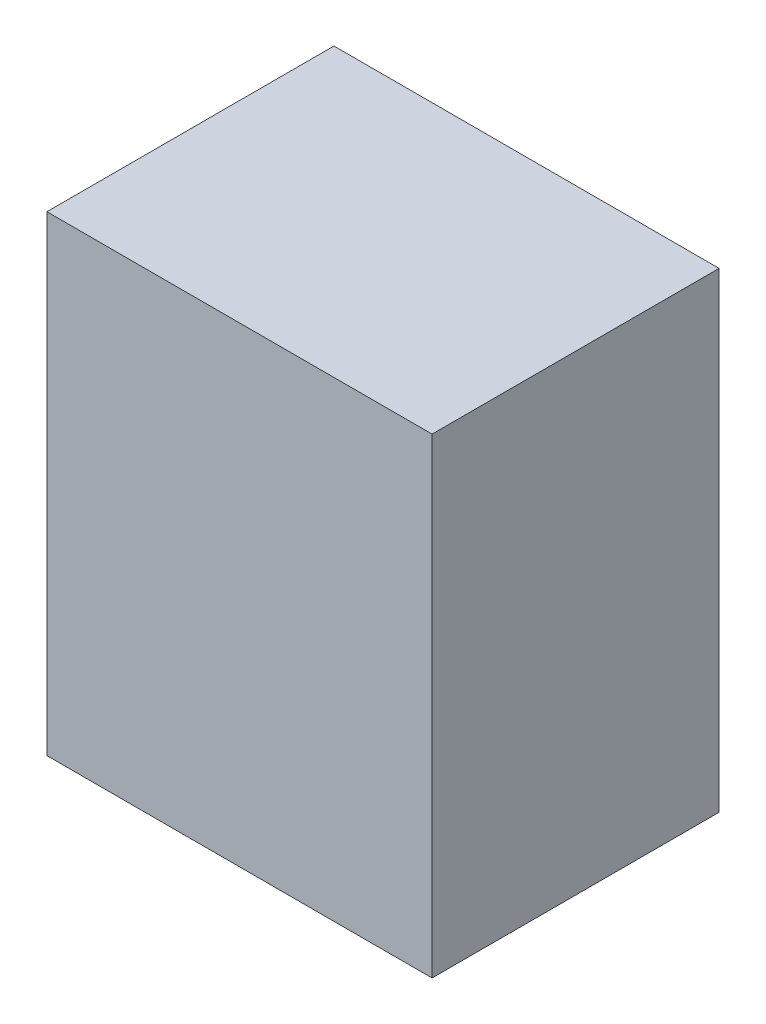
ISO-10303-21;
HEADER;
FILE_DESCRIPTION(('STEP AP214'),'2;1');
FILE_NAME('part.step','',(''),(''),'','','');
FILE_SCHEMA(('AUTOMOTIVE_DESIGN { 1 0 10303 214 1 1 1 1 }'));
ENDSEC;
DATA;
#1=APPLICATION_CONTEXT('core data for automotive mechanical design processes');
#2=APPLICATION_PROTOCOL_DEFINITION('international standard','automotive_design',2000,#1);
#3=PRODUCT_CONTEXT('',#1,'mechanical');
#4=PRODUCT('Part','Part','',(#3));
#5=PRODUCT_RELATED_PRODUCT_CATEGORY('part','',(#4));
#6=PRODUCT_DEFINITION_FORMATION('','',#4);
#7=PRODUCT_DEFINITION_CONTEXT('part definition',#1,'design');
#8=PRODUCT_DEFINITION('design','',#6,#7);
#9=PRODUCT_DEFINITION_SHAPE('','',#8);
#10=(LENGTH_UNIT() NAMED_UNIT(*) SI_UNIT(.MILLI.,.METRE.));
#11=(NAMED_UNIT(*) PLANE_ANGLE_UNIT() SI_UNIT($,.RADIAN.));
#12=(NAMED_UNIT(*) SI_UNIT($,.STERADIAN.) SOLID_ANGLE_UNIT());
#13=UNCERTAINTY_MEASURE_WITH_UNIT(LENGTH_MEASURE(1.E-05),#10,'distance_accuracy_value','');
#14=(GEOMETRIC_REPRESENTATION_CONTEXT(3) GLOBAL_UNCERTAINTY_ASSIGNED_CONTEXT((#13)) GLOBAL_UNIT_ASSIGNED_CONTEXT((#10,
#11,#12)) REPRESENTATION_CONTEXT('',''));
#15=CARTESIAN_POINT('',(0.,0.,0.));
#16=DIRECTION('',(0.,0.,1.));
#17=DIRECTION('',(1.,0.,0.));
#18=AXIS2_PLACEMENT_3D('',#15,#16,#17);
#19=CARTESIAN_POINT('',(-0.7849997,0.96000062,1.1700002));
#20=DIRECTION('',(0.,0.,1.));
#21=DIRECTION('',(1.,0.,0.));
#22=AXIS2_PLACEMENT_3D('',#19,#20,#21);
#23=PLANE('',#22);
#24=DIRECTION('',(0.,1.,0.));
#25=VECTOR('',#24,1.);
#26=CARTESIAN_POINT('',(-0.7849997,-0.96000062,1.1700002));
#27=LINE('',#26,#25);
#28=CARTESIAN_POINT('',(-0.7849997,-0.96000062,1.1700002));
#29=VERTEX_POINT('',#28);
#30=CARTESIAN_POINT('',(-0.7849997,0.96000062,1.1700002));
#31=VERTEX_POINT('',#30);
#32=EDGE_CURVE('E25',#29,#31,#27,.T.);
#33=ORIENTED_EDGE('',*,*,#32,.F.);
#34=DIRECTION('',(-1.,0.,0.));
#35=VECTOR('',#34,1.);
#36=CARTESIAN_POINT('',(0.7849997,-0.96000062,1.1700002));
#37=LINE('',#36,#35);
#38=CARTESIAN_POINT('',(0.7849997,-0.96000062,1.1700002));
#39=VERTEX_POINT('',#38);
#40=EDGE_CURVE('E108',#39,#29,#37,.T.);
#41=ORIENTED_EDGE('',*,*,#40,.F.);
#42=DIRECTION('',(0.,-1.,0.));
#43=VECTOR('',#42,1.);
#44=CARTESIAN_POINT('',(0.7849997,0.96000062,1.1700002));
#45=LINE('',#44,#43);
#46=CARTESIAN_POINT('',(0.7849997,0.96000062,1.1700002));
#47=VERTEX_POINT('',#46);
#48=EDGE_CURVE('E83',#47,#39,#45,.T.);
#49=ORIENTED_EDGE('',*,*,#48,.F.);
#50=DIRECTION('',(1.,0.,0.));
#51=VECTOR('',#50,1.);
#52=CARTESIAN_POINT('',(-0.7849997,0.96000062,1.1700002));
#53=LINE('',#52,#51);
#54=EDGE_CURVE('E87',#31,#47,#53,.T.);
#55=ORIENTED_EDGE('',*,*,#54,.F.);
#56=EDGE_LOOP('',(#33,#41,#49,#55));
#57=FACE_BOUND('',#56,.T.);
#58=ADVANCED_FACE('F17',(#57),#23,.T.);
#59=CARTESIAN_POINT('',(-0.7849997,0.96000062,0.));
#60=DIRECTION('',(0.,0.,1.));
#61=DIRECTION('',(1.,0.,0.));
#62=AXIS2_PLACEMENT_3D('',#59,#60,#61);
#63=PLANE('',#62);
#64=DIRECTION('',(1.,0.,0.));
#65=VECTOR('',#64,1.);
#66=CARTESIAN_POINT('',(-0.7849997,0.96000062,0.));
#67=LINE('',#66,#65);
#68=CARTESIAN_POINT('',(-0.7849997,0.96000062,0.));
#69=VERTEX_POINT('',#68);
#70=CARTESIAN_POINT('',(0.7849997,0.96000062,0.));
#71=VERTEX_POINT('',#70);
#72=EDGE_CURVE('E71',#69,#71,#67,.T.);
#73=ORIENTED_EDGE('',*,*,#72,.T.);
#74=DIRECTION('',(0.,-1.,0.));
#75=VECTOR('',#74,1.);
#76=CARTESIAN_POINT('',(0.7849997,0.96000062,0.));
#77=LINE('',#76,#75);
#78=CARTESIAN_POINT('',(0.7849997,-0.96000062,0.));
#79=VERTEX_POINT('',#78);
#80=EDGE_CURVE('E104',#71,#79,#77,.T.);
#81=ORIENTED_EDGE('',*,*,#80,.T.);
#82=DIRECTION('',(-1.,0.,0.));
#83=VECTOR('',#82,1.);
#84=CARTESIAN_POINT('',(0.7849997,-0.96000062,0.));
#85=LINE('',#84,#83);
#86=CARTESIAN_POINT('',(-0.7849997,-0.96000062,0.));
#87=VERTEX_POINT('',#86);
#88=EDGE_CURVE('E73',#79,#87,#85,.T.);
#89=ORIENTED_EDGE('',*,*,#88,.T.);
#90=DIRECTION('',(0.,1.,0.));
#91=VECTOR('',#90,1.);
#92=CARTESIAN_POINT('',(-0.7849997,-0.96000062,0.));
#93=LINE('',#92,#91);
#94=EDGE_CURVE('E11',#87,#69,#93,.T.);
#95=ORIENTED_EDGE('',*,*,#94,.T.);
#96=EDGE_LOOP('',(#73,#81,#89,#95));
#97=FACE_BOUND('',#96,.T.);
#98=ADVANCED_FACE('F69',(#97),#63,.F.);
#99=CARTESIAN_POINT('',(-0.7849997,-0.96000062,0.));
#100=DIRECTION('',(-1.,0.,0.));
#101=DIRECTION('',(0.,0.,1.));
#102=AXIS2_PLACEMENT_3D('',#99,#100,#101);
#103=PLANE('',#102);
#104=DIRECTION('',(0.,0.,1.));
#105=VECTOR('',#104,1.);
#106=CARTESIAN_POINT('',(-0.7849997,-0.96000062,0.));
#107=LINE('',#106,#105);
#108=EDGE_CURVE('E110',#87,#29,#107,.T.);
#109=ORIENTED_EDGE('',*,*,#108,.T.);
#110=ORIENTED_EDGE('',*,*,#32,.T.);
#111=DIRECTION('',(0.,0.,1.));
#112=VECTOR('',#111,1.);
#113=CARTESIAN_POINT('',(-0.7849997,0.96000062,0.));
#114=LINE('',#113,#112);
#115=EDGE_CURVE('E79',#69,#31,#114,.T.);
#116=ORIENTED_EDGE('',*,*,#115,.F.);
#117=ORIENTED_EDGE('',*,*,#94,.F.);
#118=EDGE_LOOP('',(#109,#110,#116,#117));
#119=FACE_BOUND('',#118,.T.);
#120=ADVANCED_FACE('F85',(#119),#103,.T.);
#121=CARTESIAN_POINT('',(0.7849997,-0.96000062,0.));
#122=DIRECTION('',(0.,-1.,0.));
#123=DIRECTION('',(0.,0.,-1.));
#124=AXIS2_PLACEMENT_3D('',#121,#122,#123);
#125=PLANE('',#124);
#126=DIRECTION('',(0.,0.,1.));
#127=VECTOR('',#126,1.);
#128=CARTESIAN_POINT('',(0.7849997,-0.96000062,0.));
#129=LINE('',#128,#127);
#130=EDGE_CURVE('E101',#79,#39,#129,.T.);
#131=ORIENTED_EDGE('',*,*,#130,.T.);
#132=ORIENTED_EDGE('',*,*,#40,.T.);
#133=ORIENTED_EDGE('',*,*,#108,.F.);
#134=ORIENTED_EDGE('',*,*,#88,.F.);
#135=EDGE_LOOP('',(#131,#132,#133,#134));
#136=FACE_BOUND('',#135,.T.);
#137=ADVANCED_FACE('F119',(#136),#125,.T.);
#138=CARTESIAN_POINT('',(0.7849997,0.96000062,0.));
#139=DIRECTION('',(1.,0.,0.));
#140=DIRECTION('',(0.,1.,0.));
#141=AXIS2_PLACEMENT_3D('',#138,#139,#140);
#142=PLANE('',#141);
#143=DIRECTION('',(0.,0.,1.));
#144=VECTOR('',#143,1.);
#145=CARTESIAN_POINT('',(0.7849997,0.96000062,0.));
#146=LINE('',#145,#144);
#147=EDGE_CURVE('E81',#71,#47,#146,.T.);
#148=ORIENTED_EDGE('',*,*,#147,.T.);
#149=ORIENTED_EDGE('',*,*,#48,.T.);
#150=ORIENTED_EDGE('',*,*,#130,.F.);
#151=ORIENTED_EDGE('',*,*,#80,.F.);
#152=EDGE_LOOP('',(#148,#149,#150,#151));
#153=FACE_BOUND('',#152,.T.);
#154=ADVANCED_FACE('F124',(#153),#142,.T.);
#155=CARTESIAN_POINT('',(-0.7849997,0.96000062,0.));
#156=DIRECTION('',(0.,1.,0.));
#157=DIRECTION('',(1.,0.,0.));
#158=AXIS2_PLACEMENT_3D('',#155,#156,#157);
#159=PLANE('',#158);
#160=ORIENTED_EDGE('',*,*,#115,.T.);
#161=ORIENTED_EDGE('',*,*,#54,.T.);
#162=ORIENTED_EDGE('',*,*,#147,.F.);
#163=ORIENTED_EDGE('',*,*,#72,.F.);
#164=EDGE_LOOP('',(#160,#161,#162,#163));
#165=FACE_BOUND('',#164,.T.);
#166=ADVANCED_FACE('F77',(#165),#159,.T.);
#167=CLOSED_SHELL('',(#58,#98,#120,#137,#154,#166));
#168=MANIFOLD_SOLID_BREP('B1',#167);
#169=ADVANCED_BREP_SHAPE_REPRESENTATION('',(#18,#168),#14);
#170=SHAPE_DEFINITION_REPRESENTATION(#9,#169);
ENDSEC;
END-ISO-10303-21;
